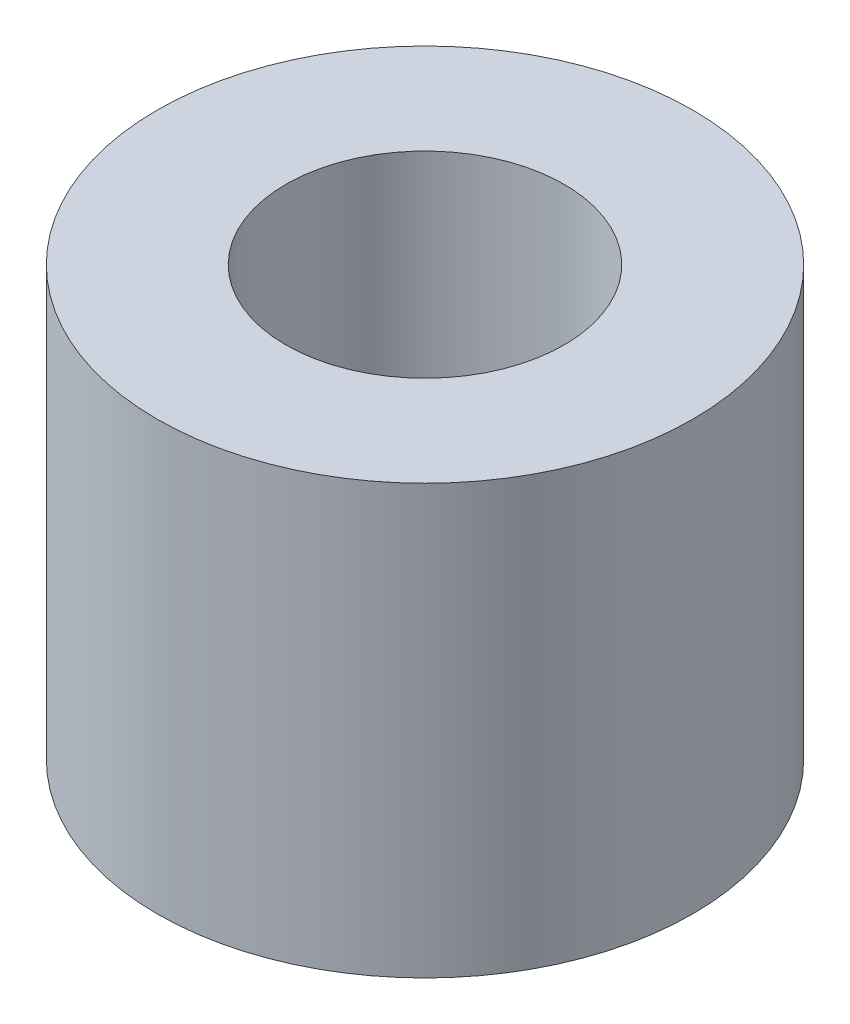
ISO-10303-21;
HEADER;
FILE_DESCRIPTION(('STEP AP214'),'2;1');
FILE_NAME('part.step','',(''),(''),'','','');
FILE_SCHEMA(('AUTOMOTIVE_DESIGN { 1 0 10303 214 1 1 1 1 }'));
ENDSEC;
DATA;
#1=APPLICATION_CONTEXT('core data for automotive mechanical design processes');
#2=APPLICATION_PROTOCOL_DEFINITION('international standard','automotive_design',2000,#1);
#3=PRODUCT_CONTEXT('',#1,'mechanical');
#4=PRODUCT('Part','Part','',(#3));
#5=PRODUCT_RELATED_PRODUCT_CATEGORY('part','',(#4));
#6=PRODUCT_DEFINITION_FORMATION('','',#4);
#7=PRODUCT_DEFINITION_CONTEXT('part definition',#1,'design');
#8=PRODUCT_DEFINITION('design','',#6,#7);
#9=PRODUCT_DEFINITION_SHAPE('','',#8);
#10=(LENGTH_UNIT() NAMED_UNIT(*) SI_UNIT(.MILLI.,.METRE.));
#11=(NAMED_UNIT(*) PLANE_ANGLE_UNIT() SI_UNIT($,.RADIAN.));
#12=(NAMED_UNIT(*) SI_UNIT($,.STERADIAN.) SOLID_ANGLE_UNIT());
#13=UNCERTAINTY_MEASURE_WITH_UNIT(LENGTH_MEASURE(1.E-05),#10,'distance_accuracy_value','');
#14=(GEOMETRIC_REPRESENTATION_CONTEXT(3) GLOBAL_UNCERTAINTY_ASSIGNED_CONTEXT((#13)) GLOBAL_UNIT_ASSIGNED_CONTEXT((#10,
#11,#12)) REPRESENTATION_CONTEXT('',''));
#15=CARTESIAN_POINT('',(0.,0.,0.));
#16=DIRECTION('',(0.,0.,1.));
#17=DIRECTION('',(1.,0.,0.));
#18=AXIS2_PLACEMENT_3D('',#15,#16,#17);
#19=CARTESIAN_POINT('',(0.,2.54,0.));
#20=DIRECTION('',(0.,-1.,0.));
#21=DIRECTION('',(0.,0.,-1.));
#22=AXIS2_PLACEMENT_3D('',#19,#20,#21);
#23=CYLINDRICAL_SURFACE('',#22,3.175);
#24=CARTESIAN_POINT('',(0.,2.54,0.));
#25=DIRECTION('',(0.,1.,0.));
#26=DIRECTION('',(0.,0.,1.));
#27=AXIS2_PLACEMENT_3D('',#24,#25,#26);
#28=CIRCLE('',#27,3.175);
#29=CARTESIAN_POINT('',(0.,2.54,3.175));
#30=VERTEX_POINT('',#29);
#31=EDGE_CURVE('E10',#30,#30,#28,.T.);
#32=ORIENTED_EDGE('',*,*,#31,.F.);
#33=EDGE_LOOP('',(#32));
#34=FACE_BOUND('',#33,.T.);
#35=CARTESIAN_POINT('',(0.,-2.54,0.));
#36=DIRECTION('',(0.,1.,0.));
#37=DIRECTION('',(0.,0.,1.));
#38=AXIS2_PLACEMENT_3D('',#35,#36,#37);
#39=CIRCLE('',#38,3.175);
#40=CARTESIAN_POINT('',(0.,-2.54,3.175));
#41=VERTEX_POINT('',#40);
#42=EDGE_CURVE('E36',#41,#41,#39,.T.);
#43=ORIENTED_EDGE('',*,*,#42,.T.);
#44=EDGE_LOOP('',(#43));
#45=FACE_BOUND('',#44,.T.);
#46=ADVANCED_FACE('F33',(#34,#45),#23,.T.);
#47=CARTESIAN_POINT('',(0.,2.54,0.));
#48=DIRECTION('',(0.,1.,0.));
#49=DIRECTION('',(0.,0.,1.));
#50=AXIS2_PLACEMENT_3D('',#47,#48,#49);
#51=PLANE('',#50);
#52=CARTESIAN_POINT('',(0.,2.54,0.));
#53=DIRECTION('',(0.,1.,0.));
#54=DIRECTION('',(0.,0.,1.));
#55=AXIS2_PLACEMENT_3D('',#52,#53,#54);
#56=CIRCLE('',#55,1.64999999999999);
#57=CARTESIAN_POINT('',(0.,2.54,1.64999999999999));
#58=VERTEX_POINT('',#57);
#59=EDGE_CURVE('E47',#58,#58,#56,.T.);
#60=ORIENTED_EDGE('',*,*,#59,.F.);
#61=EDGE_LOOP('',(#60));
#62=FACE_BOUND('',#61,.T.);
#63=ORIENTED_EDGE('',*,*,#31,.T.);
#64=EDGE_LOOP('',(#63));
#65=FACE_BOUND('',#64,.T.);
#66=ADVANCED_FACE('F54',(#62,#65),#51,.T.);
#67=CARTESIAN_POINT('',(0.,-2.54,0.));
#68=DIRECTION('',(0.,1.,0.));
#69=DIRECTION('',(0.,0.,1.));
#70=AXIS2_PLACEMENT_3D('',#67,#68,#69);
#71=PLANE('',#70);
#72=CARTESIAN_POINT('',(0.,-2.54,0.));
#73=DIRECTION('',(0.,1.,0.));
#74=DIRECTION('',(0.,0.,1.));
#75=AXIS2_PLACEMENT_3D('',#72,#73,#74);
#76=CIRCLE('',#75,1.64999999999999);
#77=CARTESIAN_POINT('',(0.,-2.54,1.64999999999999));
#78=VERTEX_POINT('',#77);
#79=EDGE_CURVE('E43',#78,#78,#76,.T.);
#80=ORIENTED_EDGE('',*,*,#79,.T.);
#81=EDGE_LOOP('',(#80));
#82=FACE_BOUND('',#81,.T.);
#83=ORIENTED_EDGE('',*,*,#42,.F.);
#84=EDGE_LOOP('',(#83));
#85=FACE_BOUND('',#84,.T.);
#86=ADVANCED_FACE('F56',(#82,#85),#71,.F.);
#87=CARTESIAN_POINT('',(0.,2.54,0.));
#88=DIRECTION('',(0.,1.,0.));
#89=DIRECTION('',(0.,0.,1.));
#90=AXIS2_PLACEMENT_3D('',#87,#88,#89);
#91=CYLINDRICAL_SURFACE('',#90,1.64999999999999);
#92=ORIENTED_EDGE('',*,*,#59,.T.);
#93=EDGE_LOOP('',(#92));
#94=FACE_BOUND('',#93,.T.);
#95=ORIENTED_EDGE('',*,*,#79,.F.);
#96=EDGE_LOOP('',(#95));
#97=FACE_BOUND('',#96,.T.);
#98=ADVANCED_FACE('F51',(#94,#97),#91,.F.);
#99=CLOSED_SHELL('',(#46,#66,#86,#98));
#100=MANIFOLD_SOLID_BREP('B2',#99);
#101=ADVANCED_BREP_SHAPE_REPRESENTATION('',(#18,#100),#14);
#102=SHAPE_DEFINITION_REPRESENTATION(#9,#101);
ENDSEC;
END-ISO-10303-21;
